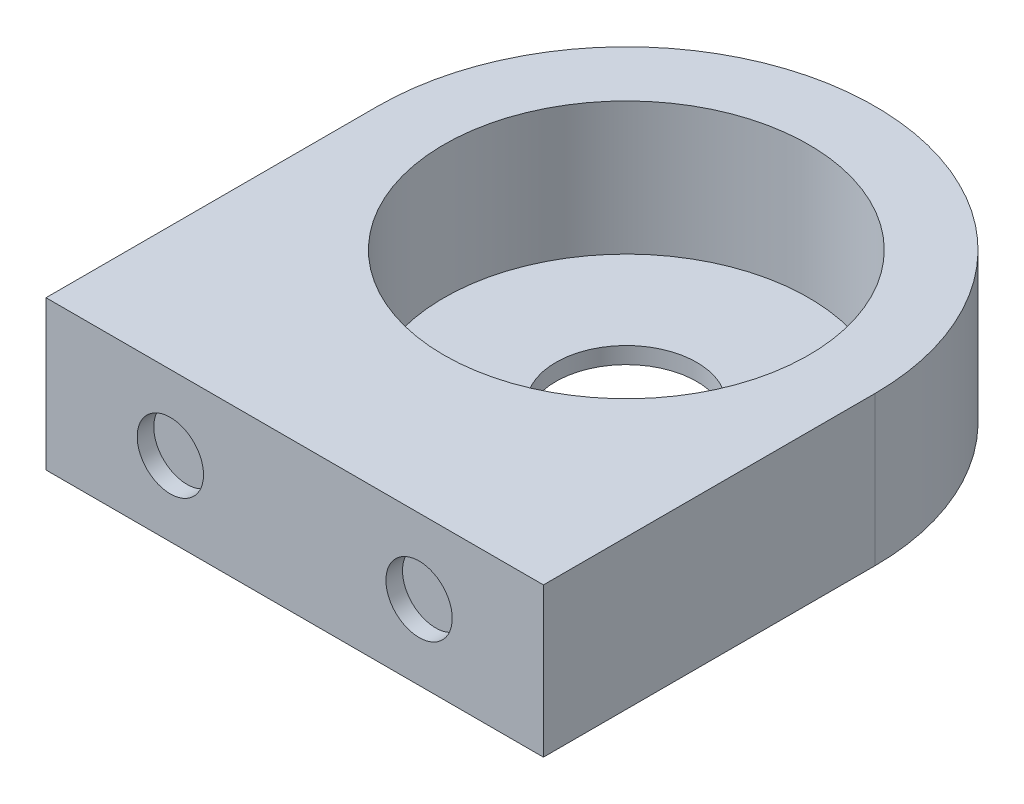
ISO-10303-21;
HEADER;
FILE_DESCRIPTION(('STEP AP214'),'2;1');
FILE_NAME('part.step','',(''),(''),'','','');
FILE_SCHEMA(('AUTOMOTIVE_DESIGN { 1 0 10303 214 1 1 1 1 }'));
ENDSEC;
DATA;
#1=APPLICATION_CONTEXT('core data for automotive mechanical design processes');
#2=APPLICATION_PROTOCOL_DEFINITION('international standard','automotive_design',2000,#1);
#3=PRODUCT_CONTEXT('',#1,'mechanical');
#4=PRODUCT('Part','Part','',(#3));
#5=PRODUCT_RELATED_PRODUCT_CATEGORY('part','',(#4));
#6=PRODUCT_DEFINITION_FORMATION('','',#4);
#7=PRODUCT_DEFINITION_CONTEXT('part definition',#1,'design');
#8=PRODUCT_DEFINITION('design','',#6,#7);
#9=PRODUCT_DEFINITION_SHAPE('','',#8);
#10=(LENGTH_UNIT() NAMED_UNIT(*) SI_UNIT(.MILLI.,.METRE.));
#11=(NAMED_UNIT(*) PLANE_ANGLE_UNIT() SI_UNIT($,.RADIAN.));
#12=(NAMED_UNIT(*) SI_UNIT($,.STERADIAN.) SOLID_ANGLE_UNIT());
#13=UNCERTAINTY_MEASURE_WITH_UNIT(LENGTH_MEASURE(1.E-05),#10,'distance_accuracy_value','');
#14=(GEOMETRIC_REPRESENTATION_CONTEXT(3) GLOBAL_UNCERTAINTY_ASSIGNED_CONTEXT((#13)) GLOBAL_UNIT_ASSIGNED_CONTEXT((#10,
#11,#12)) REPRESENTATION_CONTEXT('',''));
#15=CARTESIAN_POINT('',(0.,0.,0.));
#16=DIRECTION('',(0.,0.,1.));
#17=DIRECTION('',(1.,0.,0.));
#18=AXIS2_PLACEMENT_3D('',#15,#16,#17);
#19=CARTESIAN_POINT('',(15.,9.,-20.));
#20=DIRECTION('',(0.,-1.,0.));
#21=DIRECTION('',(0.,0.,-1.));
#22=AXIS2_PLACEMENT_3D('',#19,#20,#21);
#23=CYLINDRICAL_SURFACE('',#22,4.25);
#24=CARTESIAN_POINT('',(15.,0.,-20.));
#25=DIRECTION('',(0.,1.,0.));
#26=DIRECTION('',(0.,0.,1.));
#27=AXIS2_PLACEMENT_3D('',#24,#25,#26);
#28=CIRCLE('',#27,4.25);
#29=CARTESIAN_POINT('',(15.,0.,-15.75));
#30=VERTEX_POINT('',#29);
#31=EDGE_CURVE('E125',#30,#30,#28,.T.);
#32=ORIENTED_EDGE('',*,*,#31,.F.);
#33=EDGE_LOOP('',(#32));
#34=FACE_BOUND('',#33,.T.);
#35=CARTESIAN_POINT('',(15.,1.,-20.));
#36=DIRECTION('',(0.,1.,0.));
#37=DIRECTION('',(0.,0.,1.));
#38=AXIS2_PLACEMENT_3D('',#35,#36,#37);
#39=CIRCLE('',#38,4.25);
#40=CARTESIAN_POINT('',(15.,1.,-15.75));
#41=VERTEX_POINT('',#40);
#42=EDGE_CURVE('E46',#41,#41,#39,.T.);
#43=ORIENTED_EDGE('',*,*,#42,.T.);
#44=EDGE_LOOP('',(#43));
#45=FACE_BOUND('',#44,.T.);
#46=ADVANCED_FACE('F42',(#34,#45),#23,.F.);
#47=CARTESIAN_POINT('',(30.,9.,0.));
#48=DIRECTION('',(-1.,0.,0.));
#49=DIRECTION('',(0.,0.,1.));
#50=AXIS2_PLACEMENT_3D('',#47,#48,#49);
#51=PLANE('',#50);
#52=DIRECTION('',(0.,0.,-1.));
#53=VECTOR('',#52,1.);
#54=CARTESIAN_POINT('',(30.,0.,0.));
#55=LINE('',#54,#53);
#56=CARTESIAN_POINT('',(30.,0.,0.));
#57=VERTEX_POINT('',#56);
#58=CARTESIAN_POINT('',(30.,0.,-20.));
#59=VERTEX_POINT('',#58);
#60=EDGE_CURVE('E113',#57,#59,#55,.T.);
#61=ORIENTED_EDGE('',*,*,#60,.T.);
#62=DIRECTION('',(0.,-1.,0.));
#63=VECTOR('',#62,1.);
#64=CARTESIAN_POINT('',(30.,9.,-20.));
#65=LINE('',#64,#63);
#66=CARTESIAN_POINT('',(30.,9.,-20.));
#67=VERTEX_POINT('',#66);
#68=EDGE_CURVE('E11',#67,#59,#65,.T.);
#69=ORIENTED_EDGE('',*,*,#68,.F.);
#70=DIRECTION('',(0.,0.,-1.));
#71=VECTOR('',#70,1.);
#72=CARTESIAN_POINT('',(30.,9.,0.));
#73=LINE('',#72,#71);
#74=CARTESIAN_POINT('',(30.,9.,0.));
#75=VERTEX_POINT('',#74);
#76=EDGE_CURVE('E94',#75,#67,#73,.T.);
#77=ORIENTED_EDGE('',*,*,#76,.F.);
#78=DIRECTION('',(0.,-1.,0.));
#79=VECTOR('',#78,1.);
#80=CARTESIAN_POINT('',(30.,9.,0.));
#81=LINE('',#80,#79);
#82=EDGE_CURVE('E61',#75,#57,#81,.T.);
#83=ORIENTED_EDGE('',*,*,#82,.T.);
#84=EDGE_LOOP('',(#61,#69,#77,#83));
#85=FACE_BOUND('',#84,.T.);
#86=ADVANCED_FACE('F44',(#85),#51,.F.);
#87=CARTESIAN_POINT('',(15.,9.,-20.));
#88=DIRECTION('',(0.,-1.,0.));
#89=DIRECTION('',(0.,0.,-1.));
#90=AXIS2_PLACEMENT_3D('',#87,#88,#89);
#91=CYLINDRICAL_SURFACE('',#90,15.);
#92=CARTESIAN_POINT('',(15.,0.,-20.));
#93=DIRECTION('',(0.,1.,0.));
#94=DIRECTION('',(0.,0.,1.));
#95=AXIS2_PLACEMENT_3D('',#92,#93,#94);
#96=CIRCLE('',#95,15.);
#97=CARTESIAN_POINT('',(0.,0.,-20.));
#98=VERTEX_POINT('',#97);
#99=EDGE_CURVE('E100',#59,#98,#96,.T.);
#100=ORIENTED_EDGE('',*,*,#99,.T.);
#101=DIRECTION('',(0.,-1.,0.));
#102=VECTOR('',#101,1.);
#103=CARTESIAN_POINT('',(0.,9.,-20.));
#104=LINE('',#103,#102);
#105=CARTESIAN_POINT('',(0.,9.,-20.));
#106=VERTEX_POINT('',#105);
#107=EDGE_CURVE('E53',#106,#98,#104,.T.);
#108=ORIENTED_EDGE('',*,*,#107,.F.);
#109=CARTESIAN_POINT('',(15.,9.,-20.));
#110=DIRECTION('',(0.,1.,0.));
#111=DIRECTION('',(0.,0.,1.));
#112=AXIS2_PLACEMENT_3D('',#109,#110,#111);
#113=CIRCLE('',#112,15.);
#114=EDGE_CURVE('E86',#67,#106,#113,.T.);
#115=ORIENTED_EDGE('',*,*,#114,.F.);
#116=ORIENTED_EDGE('',*,*,#68,.T.);
#117=EDGE_LOOP('',(#100,#108,#115,#116));
#118=FACE_BOUND('',#117,.T.);
#119=ADVANCED_FACE('F99',(#118),#91,.T.);
#120=CARTESIAN_POINT('',(0.,9.,0.));
#121=DIRECTION('',(-1.,0.,0.));
#122=DIRECTION('',(0.,0.,1.));
#123=AXIS2_PLACEMENT_3D('',#120,#121,#122);
#124=PLANE('',#123);
#125=DIRECTION('',(0.,0.,-1.));
#126=VECTOR('',#125,1.);
#127=CARTESIAN_POINT('',(0.,0.,0.));
#128=LINE('',#127,#126);
#129=CARTESIAN_POINT('',(0.,0.,0.));
#130=VERTEX_POINT('',#129);
#131=EDGE_CURVE('E118',#130,#98,#128,.T.);
#132=ORIENTED_EDGE('',*,*,#131,.F.);
#133=DIRECTION('',(0.,-1.,0.));
#134=VECTOR('',#133,1.);
#135=CARTESIAN_POINT('',(0.,9.,0.));
#136=LINE('',#135,#134);
#137=CARTESIAN_POINT('',(0.,9.,0.));
#138=VERTEX_POINT('',#137);
#139=EDGE_CURVE('E75',#138,#130,#136,.T.);
#140=ORIENTED_EDGE('',*,*,#139,.F.);
#141=DIRECTION('',(0.,0.,-1.));
#142=VECTOR('',#141,1.);
#143=CARTESIAN_POINT('',(0.,9.,0.));
#144=LINE('',#143,#142);
#145=EDGE_CURVE('E93',#138,#106,#144,.T.);
#146=ORIENTED_EDGE('',*,*,#145,.T.);
#147=ORIENTED_EDGE('',*,*,#107,.T.);
#148=EDGE_LOOP('',(#132,#140,#146,#147));
#149=FACE_BOUND('',#148,.T.);
#150=ADVANCED_FACE('F105',(#149),#124,.T.);
#151=CARTESIAN_POINT('',(0.,9.,0.));
#152=DIRECTION('',(0.,0.,1.));
#153=DIRECTION('',(1.,0.,0.));
#154=AXIS2_PLACEMENT_3D('',#151,#152,#153);
#155=PLANE('',#154);
#156=CARTESIAN_POINT('',(7.5,4.5,0.));
#157=DIRECTION('',(0.,0.,1.));
#158=DIRECTION('',(1.,0.,0.));
#159=AXIS2_PLACEMENT_3D('',#156,#157,#158);
#160=CIRCLE('',#159,2.);
#161=CARTESIAN_POINT('',(9.5,4.5,0.));
#162=VERTEX_POINT('',#161);
#163=EDGE_CURVE('E153',#162,#162,#160,.T.);
#164=ORIENTED_EDGE('',*,*,#163,.F.);
#165=EDGE_LOOP('',(#164));
#166=FACE_BOUND('',#165,.T.);
#167=CARTESIAN_POINT('',(22.5,4.5,0.));
#168=DIRECTION('',(0.,0.,1.));
#169=DIRECTION('',(1.,0.,0.));
#170=AXIS2_PLACEMENT_3D('',#167,#168,#169);
#171=CIRCLE('',#170,2.);
#172=CARTESIAN_POINT('',(24.5,4.5,0.));
#173=VERTEX_POINT('',#172);
#174=EDGE_CURVE('E149',#173,#173,#171,.T.);
#175=ORIENTED_EDGE('',*,*,#174,.F.);
#176=EDGE_LOOP('',(#175));
#177=FACE_BOUND('',#176,.T.);
#178=DIRECTION('',(-1.,0.,0.));
#179=VECTOR('',#178,1.);
#180=CARTESIAN_POINT('',(0.,0.,0.));
#181=LINE('',#180,#179);
#182=EDGE_CURVE('E121',#57,#130,#181,.T.);
#183=ORIENTED_EDGE('',*,*,#182,.F.);
#184=ORIENTED_EDGE('',*,*,#82,.F.);
#185=DIRECTION('',(-1.,0.,0.));
#186=VECTOR('',#185,1.);
#187=CARTESIAN_POINT('',(0.,9.,0.));
#188=LINE('',#187,#186);
#189=EDGE_CURVE('E107',#75,#138,#188,.T.);
#190=ORIENTED_EDGE('',*,*,#189,.T.);
#191=ORIENTED_EDGE('',*,*,#139,.T.);
#192=EDGE_LOOP('',(#183,#184,#190,#191));
#193=FACE_BOUND('',#192,.T.);
#194=ADVANCED_FACE('F170',(#166,#177,#193),#155,.T.);
#195=CARTESIAN_POINT('',(0.,9.,0.));
#196=DIRECTION('',(0.,1.,0.));
#197=DIRECTION('',(0.,0.,1.));
#198=AXIS2_PLACEMENT_3D('',#195,#196,#197);
#199=PLANE('',#198);
#200=CARTESIAN_POINT('',(15.,9.,-20.));
#201=DIRECTION('',(0.,1.,0.));
#202=DIRECTION('',(0.,0.,1.));
#203=AXIS2_PLACEMENT_3D('',#200,#201,#202);
#204=CIRCLE('',#203,11.);
#205=CARTESIAN_POINT('',(15.,9.,-9.));
#206=VERTEX_POINT('',#205);
#207=EDGE_CURVE('E136',#206,#206,#204,.T.);
#208=ORIENTED_EDGE('',*,*,#207,.F.);
#209=EDGE_LOOP('',(#208));
#210=FACE_BOUND('',#209,.T.);
#211=ORIENTED_EDGE('',*,*,#76,.T.);
#212=ORIENTED_EDGE('',*,*,#114,.T.);
#213=ORIENTED_EDGE('',*,*,#145,.F.);
#214=ORIENTED_EDGE('',*,*,#189,.F.);
#215=EDGE_LOOP('',(#211,#212,#213,#214));
#216=FACE_BOUND('',#215,.T.);
#217=ADVANCED_FACE('F90',(#210,#216),#199,.T.);
#218=CARTESIAN_POINT('',(0.,0.,0.));
#219=DIRECTION('',(0.,1.,0.));
#220=DIRECTION('',(0.,0.,1.));
#221=AXIS2_PLACEMENT_3D('',#218,#219,#220);
#222=PLANE('',#221);
#223=ORIENTED_EDGE('',*,*,#60,.F.);
#224=ORIENTED_EDGE('',*,*,#182,.T.);
#225=ORIENTED_EDGE('',*,*,#131,.T.);
#226=ORIENTED_EDGE('',*,*,#99,.F.);
#227=EDGE_LOOP('',(#223,#224,#225,#226));
#228=FACE_BOUND('',#227,.T.);
#229=ORIENTED_EDGE('',*,*,#31,.T.);
#230=EDGE_LOOP('',(#229));
#231=FACE_BOUND('',#230,.T.);
#232=ADVANCED_FACE('F176',(#228,#231),#222,.F.);
#233=CARTESIAN_POINT('',(15.,1.,-20.));
#234=DIRECTION('',(0.,1.,0.));
#235=DIRECTION('',(0.,0.,1.));
#236=AXIS2_PLACEMENT_3D('',#233,#234,#235);
#237=CYLINDRICAL_SURFACE('',#236,11.);
#238=CARTESIAN_POINT('',(15.,1.,-20.));
#239=DIRECTION('',(0.,1.,0.));
#240=DIRECTION('',(0.,0.,1.));
#241=AXIS2_PLACEMENT_3D('',#238,#239,#240);
#242=CIRCLE('',#241,11.);
#243=CARTESIAN_POINT('',(15.,1.,-9.));
#244=VERTEX_POINT('',#243);
#245=EDGE_CURVE('E140',#244,#244,#242,.T.);
#246=ORIENTED_EDGE('',*,*,#245,.F.);
#247=EDGE_LOOP('',(#246));
#248=FACE_BOUND('',#247,.T.);
#249=ORIENTED_EDGE('',*,*,#207,.T.);
#250=EDGE_LOOP('',(#249));
#251=FACE_BOUND('',#250,.T.);
#252=ADVANCED_FACE('F214',(#248,#251),#237,.F.);
#253=CARTESIAN_POINT('',(15.,1.,-20.));
#254=DIRECTION('',(0.,1.,0.));
#255=DIRECTION('',(0.,0.,1.));
#256=AXIS2_PLACEMENT_3D('',#253,#254,#255);
#257=PLANE('',#256);
#258=ORIENTED_EDGE('',*,*,#42,.F.);
#259=EDGE_LOOP('',(#258));
#260=FACE_BOUND('',#259,.T.);
#261=ORIENTED_EDGE('',*,*,#245,.T.);
#262=EDGE_LOOP('',(#261));
#263=FACE_BOUND('',#262,.T.);
#264=ADVANCED_FACE('F219',(#260,#263),#257,.T.);
#265=CARTESIAN_POINT('',(22.5,4.5,-1.));
#266=DIRECTION('',(0.,0.,1.));
#267=DIRECTION('',(1.,0.,0.));
#268=AXIS2_PLACEMENT_3D('',#265,#266,#267);
#269=CYLINDRICAL_SURFACE('',#268,2.);
#270=CARTESIAN_POINT('',(22.5,4.5,-1.));
#271=DIRECTION('',(0.,0.,1.));
#272=DIRECTION('',(1.,0.,0.));
#273=AXIS2_PLACEMENT_3D('',#270,#271,#272);
#274=CIRCLE('',#273,2.);
#275=CARTESIAN_POINT('',(24.5,4.5,-1.));
#276=VERTEX_POINT('',#275);
#277=EDGE_CURVE('E145',#276,#276,#274,.T.);
#278=ORIENTED_EDGE('',*,*,#277,.F.);
#279=EDGE_LOOP('',(#278));
#280=FACE_BOUND('',#279,.T.);
#281=ORIENTED_EDGE('',*,*,#174,.T.);
#282=EDGE_LOOP('',(#281));
#283=FACE_BOUND('',#282,.T.);
#284=ADVANCED_FACE('F226',(#280,#283),#269,.F.);
#285=CARTESIAN_POINT('',(22.5,4.5,-1.));
#286=DIRECTION('',(0.,0.,1.));
#287=DIRECTION('',(1.,0.,0.));
#288=AXIS2_PLACEMENT_3D('',#285,#286,#287);
#289=PLANE('',#288);
#290=ORIENTED_EDGE('',*,*,#277,.T.);
#291=EDGE_LOOP('',(#290));
#292=FACE_BOUND('',#291,.T.);
#293=ADVANCED_FACE('F166',(#292),#289,.T.);
#294=CARTESIAN_POINT('',(7.5,4.5,-1.));
#295=DIRECTION('',(0.,0.,1.));
#296=DIRECTION('',(1.,0.,0.));
#297=AXIS2_PLACEMENT_3D('',#294,#295,#296);
#298=CYLINDRICAL_SURFACE('',#297,2.);
#299=CARTESIAN_POINT('',(7.5,4.5,-1.));
#300=DIRECTION('',(0.,0.,1.));
#301=DIRECTION('',(1.,0.,0.));
#302=AXIS2_PLACEMENT_3D('',#299,#300,#301);
#303=CIRCLE('',#302,2.);
#304=CARTESIAN_POINT('',(9.5,4.5,-1.));
#305=VERTEX_POINT('',#304);
#306=EDGE_CURVE('E141',#305,#305,#303,.T.);
#307=ORIENTED_EDGE('',*,*,#306,.F.);
#308=EDGE_LOOP('',(#307));
#309=FACE_BOUND('',#308,.T.);
#310=ORIENTED_EDGE('',*,*,#163,.T.);
#311=EDGE_LOOP('',(#310));
#312=FACE_BOUND('',#311,.T.);
#313=ADVANCED_FACE('F163',(#309,#312),#298,.F.);
#314=CARTESIAN_POINT('',(7.5,4.5,-1.));
#315=DIRECTION('',(0.,0.,1.));
#316=DIRECTION('',(1.,0.,0.));
#317=AXIS2_PLACEMENT_3D('',#314,#315,#316);
#318=PLANE('',#317);
#319=ORIENTED_EDGE('',*,*,#306,.T.);
#320=EDGE_LOOP('',(#319));
#321=FACE_BOUND('',#320,.T.);
#322=ADVANCED_FACE('F161',(#321),#318,.T.);
#323=CLOSED_SHELL('',(#46,#86,#119,#150,#194,#217,#232,#252,#264,#284,#293,#313,#322));
#324=MANIFOLD_SOLID_BREP('B2',#323);
#325=ADVANCED_BREP_SHAPE_REPRESENTATION('',(#18,#324),#14);
#326=SHAPE_DEFINITION_REPRESENTATION(#9,#325);
ENDSEC;
END-ISO-10303-21;
